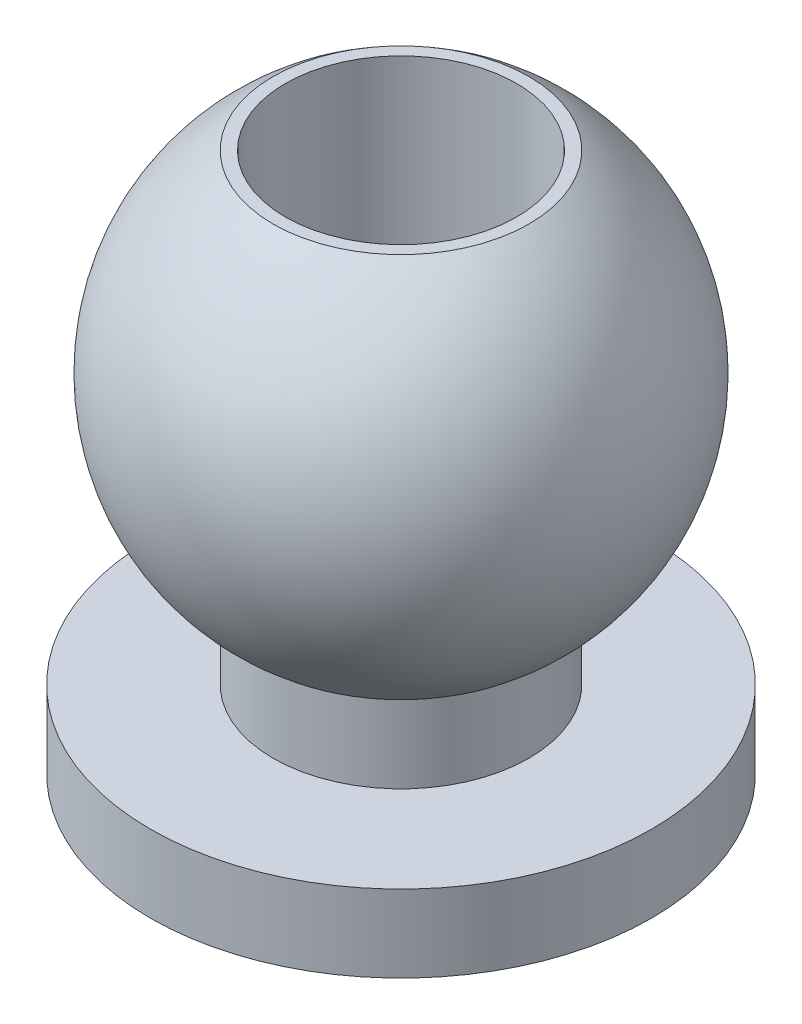
ISO-10303-21;
HEADER;
FILE_DESCRIPTION(('STEP AP214'),'2;1');
FILE_NAME('part.step','',(''),(''),'','','');
FILE_SCHEMA(('AUTOMOTIVE_DESIGN { 1 0 10303 214 1 1 1 1 }'));
ENDSEC;
DATA;
#1=APPLICATION_CONTEXT('core data for automotive mechanical design processes');
#2=APPLICATION_PROTOCOL_DEFINITION('international standard','automotive_design',2000,#1);
#3=PRODUCT_CONTEXT('',#1,'mechanical');
#4=PRODUCT('Part','Part','',(#3));
#5=PRODUCT_RELATED_PRODUCT_CATEGORY('part','',(#4));
#6=PRODUCT_DEFINITION_FORMATION('','',#4);
#7=PRODUCT_DEFINITION_CONTEXT('part definition',#1,'design');
#8=PRODUCT_DEFINITION('design','',#6,#7);
#9=PRODUCT_DEFINITION_SHAPE('','',#8);
#10=(LENGTH_UNIT() NAMED_UNIT(*) SI_UNIT(.MILLI.,.METRE.));
#11=(NAMED_UNIT(*) PLANE_ANGLE_UNIT() SI_UNIT($,.RADIAN.));
#12=(NAMED_UNIT(*) SI_UNIT($,.STERADIAN.) SOLID_ANGLE_UNIT());
#13=UNCERTAINTY_MEASURE_WITH_UNIT(LENGTH_MEASURE(1.E-05),#10,'distance_accuracy_value','');
#14=(GEOMETRIC_REPRESENTATION_CONTEXT(3) GLOBAL_UNCERTAINTY_ASSIGNED_CONTEXT((#13)) GLOBAL_UNIT_ASSIGNED_CONTEXT((#10,
#11,#12)) REPRESENTATION_CONTEXT('',''));
#15=CARTESIAN_POINT('',(0.,0.,0.));
#16=DIRECTION('',(0.,0.,1.));
#17=DIRECTION('',(1.,0.,0.));
#18=AXIS2_PLACEMENT_3D('',#15,#16,#17);
#19=CARTESIAN_POINT('',(-1.6583123951777,7.,0.));
#20=DIRECTION('',(0.,-1.,0.));
#21=DIRECTION('',(0.,0.,-1.));
#22=AXIS2_PLACEMENT_3D('',#19,#20,#21);
#23=PLANE('',#22);
#24=CARTESIAN_POINT('',(0.,7.,0.));
#25=DIRECTION('',(0.,1.,0.));
#26=DIRECTION('',(0.,0.,1.));
#27=AXIS2_PLACEMENT_3D('',#24,#25,#26);
#28=CIRCLE('',#27,1.5);
#29=CARTESIAN_POINT('',(0.,7.,1.5));
#30=VERTEX_POINT('',#29);
#31=EDGE_CURVE('E73',#30,#30,#28,.T.);
#32=ORIENTED_EDGE('',*,*,#31,.F.);
#33=EDGE_LOOP('',(#32));
#34=FACE_BOUND('',#33,.T.);
#35=CARTESIAN_POINT('',(0.,7.,0.));
#36=DIRECTION('',(0.,-1.,0.));
#37=DIRECTION('',(0.,0.,-1.));
#38=AXIS2_PLACEMENT_3D('',#35,#36,#37);
#39=CIRCLE('',#38,1.6583123951777);
#40=CARTESIAN_POINT('',(0.,7.,-1.6583123951777));
#41=VERTEX_POINT('',#40);
#42=EDGE_CURVE('E10',#41,#41,#39,.T.);
#43=ORIENTED_EDGE('',*,*,#42,.F.);
#44=EDGE_LOOP('',(#43));
#45=FACE_BOUND('',#44,.T.);
#46=ADVANCED_FACE('F45',(#34,#45),#23,.F.);
#47=CARTESIAN_POINT('',(0.,4.5,0.));
#48=DIRECTION('',(0.,-1.,0.));
#49=DIRECTION('',(-1.,0.,0.));
#50=AXIS2_PLACEMENT_3D('',#47,#48,#49);
#51=SPHERICAL_SURFACE('',#50,3.);
#52=CARTESIAN_POINT('',(0.,2.,0.));
#53=DIRECTION('',(0.,-1.,0.));
#54=DIRECTION('',(0.,0.,-1.));
#55=AXIS2_PLACEMENT_3D('',#52,#53,#54);
#56=CIRCLE('',#55,1.6583123951777);
#57=CARTESIAN_POINT('',(0.,2.,-1.6583123951777));
#58=VERTEX_POINT('',#57);
#59=EDGE_CURVE('E52',#58,#58,#56,.T.);
#60=ORIENTED_EDGE('',*,*,#59,.F.);
#61=EDGE_LOOP('',(#60));
#62=FACE_BOUND('',#61,.T.);
#63=ORIENTED_EDGE('',*,*,#42,.T.);
#64=EDGE_LOOP('',(#63));
#65=FACE_BOUND('',#64,.T.);
#66=ADVANCED_FACE('F92',(#62,#65),#51,.T.);
#67=CARTESIAN_POINT('',(0.,0.,0.));
#68=DIRECTION('',(0.,-1.,0.));
#69=DIRECTION('',(0.,0.,-1.));
#70=AXIS2_PLACEMENT_3D('',#67,#68,#69);
#71=CYLINDRICAL_SURFACE('',#70,1.6583123951777);
#72=CARTESIAN_POINT('',(0.,1.,0.));
#73=DIRECTION('',(0.,-1.,0.));
#74=DIRECTION('',(0.,0.,-1.));
#75=AXIS2_PLACEMENT_3D('',#72,#73,#74);
#76=CIRCLE('',#75,1.6583123951777);
#77=CARTESIAN_POINT('',(0.,1.,-1.6583123951777));
#78=VERTEX_POINT('',#77);
#79=EDGE_CURVE('E57',#78,#78,#76,.T.);
#80=ORIENTED_EDGE('',*,*,#79,.F.);
#81=EDGE_LOOP('',(#80));
#82=FACE_BOUND('',#81,.T.);
#83=ORIENTED_EDGE('',*,*,#59,.T.);
#84=EDGE_LOOP('',(#83));
#85=FACE_BOUND('',#84,.T.);
#86=ADVANCED_FACE('F98',(#82,#85),#71,.T.);
#87=CARTESIAN_POINT('',(-3.25,1.,0.));
#88=DIRECTION('',(0.,-1.,0.));
#89=DIRECTION('',(0.,0.,-1.));
#90=AXIS2_PLACEMENT_3D('',#87,#88,#89);
#91=PLANE('',#90);
#92=CARTESIAN_POINT('',(0.,1.,0.));
#93=DIRECTION('',(0.,-1.,0.));
#94=DIRECTION('',(0.,0.,-1.));
#95=AXIS2_PLACEMENT_3D('',#92,#93,#94);
#96=CIRCLE('',#95,3.25);
#97=CARTESIAN_POINT('',(0.,1.,-3.25));
#98=VERTEX_POINT('',#97);
#99=EDGE_CURVE('E62',#98,#98,#96,.T.);
#100=ORIENTED_EDGE('',*,*,#99,.F.);
#101=EDGE_LOOP('',(#100));
#102=FACE_BOUND('',#101,.T.);
#103=ORIENTED_EDGE('',*,*,#79,.T.);
#104=EDGE_LOOP('',(#103));
#105=FACE_BOUND('',#104,.T.);
#106=ADVANCED_FACE('F103',(#102,#105),#91,.F.);
#107=CARTESIAN_POINT('',(0.,0.,0.));
#108=DIRECTION('',(0.,-1.,0.));
#109=DIRECTION('',(0.,0.,-1.));
#110=AXIS2_PLACEMENT_3D('',#107,#108,#109);
#111=CYLINDRICAL_SURFACE('',#110,3.25);
#112=CARTESIAN_POINT('',(0.,0.,0.));
#113=DIRECTION('',(0.,-1.,0.));
#114=DIRECTION('',(0.,0.,-1.));
#115=AXIS2_PLACEMENT_3D('',#112,#113,#114);
#116=CIRCLE('',#115,3.25);
#117=CARTESIAN_POINT('',(0.,0.,-3.25));
#118=VERTEX_POINT('',#117);
#119=EDGE_CURVE('E68',#118,#118,#116,.T.);
#120=ORIENTED_EDGE('',*,*,#119,.F.);
#121=EDGE_LOOP('',(#120));
#122=FACE_BOUND('',#121,.T.);
#123=ORIENTED_EDGE('',*,*,#99,.T.);
#124=EDGE_LOOP('',(#123));
#125=FACE_BOUND('',#124,.T.);
#126=ADVANCED_FACE('F109',(#122,#125),#111,.T.);
#127=CARTESIAN_POINT('',(0.,0.,0.));
#128=DIRECTION('',(0.,1.,0.));
#129=DIRECTION('',(0.,0.,1.));
#130=AXIS2_PLACEMENT_3D('',#127,#128,#129);
#131=PLANE('',#130);
#132=CARTESIAN_POINT('',(0.,0.,0.));
#133=DIRECTION('',(0.,1.,0.));
#134=DIRECTION('',(0.,0.,1.));
#135=AXIS2_PLACEMENT_3D('',#132,#133,#134);
#136=CIRCLE('',#135,1.5);
#137=CARTESIAN_POINT('',(0.,0.,1.5));
#138=VERTEX_POINT('',#137);
#139=EDGE_CURVE('E72',#138,#138,#136,.T.);
#140=ORIENTED_EDGE('',*,*,#139,.T.);
#141=EDGE_LOOP('',(#140));
#142=FACE_BOUND('',#141,.T.);
#143=ORIENTED_EDGE('',*,*,#119,.T.);
#144=EDGE_LOOP('',(#143));
#145=FACE_BOUND('',#144,.T.);
#146=ADVANCED_FACE('F81',(#142,#145),#131,.F.);
#147=CARTESIAN_POINT('',(0.,0.,0.));
#148=DIRECTION('',(0.,1.,0.));
#149=DIRECTION('',(0.,0.,1.));
#150=AXIS2_PLACEMENT_3D('',#147,#148,#149);
#151=CYLINDRICAL_SURFACE('',#150,1.5);
#152=ORIENTED_EDGE('',*,*,#139,.F.);
#153=EDGE_LOOP('',(#152));
#154=FACE_BOUND('',#153,.T.);
#155=ORIENTED_EDGE('',*,*,#31,.T.);
#156=EDGE_LOOP('',(#155));
#157=FACE_BOUND('',#156,.T.);
#158=ADVANCED_FACE('F84',(#154,#157),#151,.F.);
#159=CLOSED_SHELL('',(#46,#66,#86,#106,#126,#146,#158));
#160=MANIFOLD_SOLID_BREP('B2',#159);
#161=ADVANCED_BREP_SHAPE_REPRESENTATION('',(#18,#160),#14);
#162=SHAPE_DEFINITION_REPRESENTATION(#9,#161);
ENDSEC;
END-ISO-10303-21;
